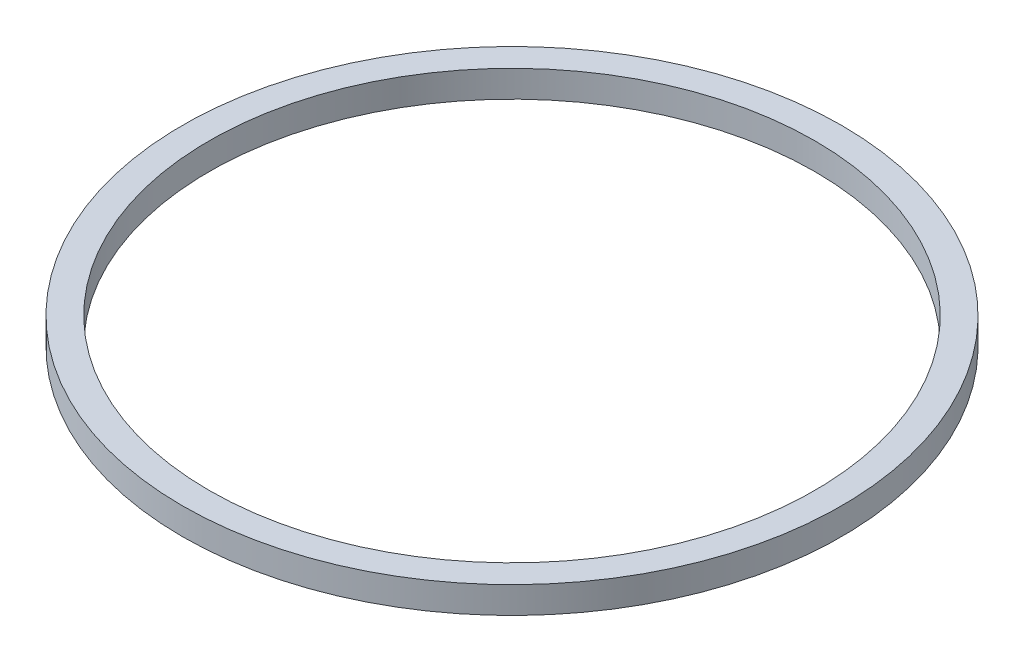
ISO-10303-21;
HEADER;
FILE_DESCRIPTION(('STEP AP214'),'2;1');
FILE_NAME('part.step','',(''),(''),'','','');
FILE_SCHEMA(('AUTOMOTIVE_DESIGN { 1 0 10303 214 1 1 1 1 }'));
ENDSEC;
DATA;
#1=APPLICATION_CONTEXT('core data for automotive mechanical design processes');
#2=APPLICATION_PROTOCOL_DEFINITION('international standard','automotive_design',2000,#1);
#3=PRODUCT_CONTEXT('',#1,'mechanical');
#4=PRODUCT('Part','Part','',(#3));
#5=PRODUCT_RELATED_PRODUCT_CATEGORY('part','',(#4));
#6=PRODUCT_DEFINITION_FORMATION('','',#4);
#7=PRODUCT_DEFINITION_CONTEXT('part definition',#1,'design');
#8=PRODUCT_DEFINITION('design','',#6,#7);
#9=PRODUCT_DEFINITION_SHAPE('','',#8);
#10=(LENGTH_UNIT() NAMED_UNIT(*) SI_UNIT(.MILLI.,.METRE.));
#11=(NAMED_UNIT(*) PLANE_ANGLE_UNIT() SI_UNIT($,.RADIAN.));
#12=(NAMED_UNIT(*) SI_UNIT($,.STERADIAN.) SOLID_ANGLE_UNIT());
#13=UNCERTAINTY_MEASURE_WITH_UNIT(LENGTH_MEASURE(1.E-05),#10,'distance_accuracy_value','');
#14=(GEOMETRIC_REPRESENTATION_CONTEXT(3) GLOBAL_UNCERTAINTY_ASSIGNED_CONTEXT((#13)) GLOBAL_UNIT_ASSIGNED_CONTEXT((#10,
#11,#12)) REPRESENTATION_CONTEXT('',''));
#15=CARTESIAN_POINT('',(0.,0.,0.));
#16=DIRECTION('',(0.,0.,1.));
#17=DIRECTION('',(1.,0.,0.));
#18=AXIS2_PLACEMENT_3D('',#15,#16,#17);
#19=CARTESIAN_POINT('',(0.,1.5,0.));
#20=DIRECTION('',(0.,1.,0.));
#21=DIRECTION('',(0.,0.,1.));
#22=AXIS2_PLACEMENT_3D('',#19,#20,#21);
#23=PLANE('',#22);
#24=CARTESIAN_POINT('',(0.,1.5,0.));
#25=DIRECTION('',(0.,1.,0.));
#26=DIRECTION('',(0.,0.,1.));
#27=AXIS2_PLACEMENT_3D('',#24,#25,#26);
#28=CIRCLE('',#27,17.);
#29=CARTESIAN_POINT('',(0.,1.5,17.));
#30=VERTEX_POINT('',#29);
#31=EDGE_CURVE('E26',#30,#30,#28,.F.);
#32=ORIENTED_EDGE('',*,*,#31,.T.);
#33=EDGE_LOOP('',(#32));
#34=FACE_BOUND('',#33,.T.);
#35=CARTESIAN_POINT('',(0.,1.5,0.));
#36=DIRECTION('',(0.,1.,0.));
#37=DIRECTION('',(0.,0.,1.));
#38=AXIS2_PLACEMENT_3D('',#35,#36,#37);
#39=CIRCLE('',#38,18.5);
#40=CARTESIAN_POINT('',(0.,1.5,18.5));
#41=VERTEX_POINT('',#40);
#42=EDGE_CURVE('E17',#41,#41,#39,.F.);
#43=ORIENTED_EDGE('',*,*,#42,.F.);
#44=EDGE_LOOP('',(#43));
#45=FACE_BOUND('',#44,.T.);
#46=ADVANCED_FACE('F14',(#34,#45),#23,.T.);
#47=CARTESIAN_POINT('',(0.,0.,0.));
#48=DIRECTION('',(0.,1.,0.));
#49=DIRECTION('',(0.,0.,1.));
#50=AXIS2_PLACEMENT_3D('',#47,#48,#49);
#51=CYLINDRICAL_SURFACE('',#50,18.5);
#52=ORIENTED_EDGE('',*,*,#42,.T.);
#53=EDGE_LOOP('',(#52));
#54=FACE_BOUND('',#53,.T.);
#55=CARTESIAN_POINT('',(0.,0.,0.));
#56=DIRECTION('',(0.,1.,0.));
#57=DIRECTION('',(0.,0.,1.));
#58=AXIS2_PLACEMENT_3D('',#55,#56,#57);
#59=CIRCLE('',#58,18.5);
#60=CARTESIAN_POINT('',(0.,0.,18.5));
#61=VERTEX_POINT('',#60);
#62=EDGE_CURVE('E21',#61,#61,#59,.T.);
#63=ORIENTED_EDGE('',*,*,#62,.T.);
#64=EDGE_LOOP('',(#63));
#65=FACE_BOUND('',#64,.T.);
#66=ADVANCED_FACE('F34',(#54,#65),#51,.T.);
#67=CARTESIAN_POINT('',(0.,0.,0.));
#68=DIRECTION('',(0.,1.,0.));
#69=DIRECTION('',(0.,0.,1.));
#70=AXIS2_PLACEMENT_3D('',#67,#68,#69);
#71=CYLINDRICAL_SURFACE('',#70,17.);
#72=ORIENTED_EDGE('',*,*,#31,.F.);
#73=EDGE_LOOP('',(#72));
#74=FACE_BOUND('',#73,.T.);
#75=CARTESIAN_POINT('',(0.,0.,0.));
#76=DIRECTION('',(0.,1.,0.));
#77=DIRECTION('',(0.,0.,1.));
#78=AXIS2_PLACEMENT_3D('',#75,#76,#77);
#79=CIRCLE('',#78,17.);
#80=CARTESIAN_POINT('',(0.,0.,17.));
#81=VERTEX_POINT('',#80);
#82=EDGE_CURVE('E10',#81,#81,#79,.F.);
#83=ORIENTED_EDGE('',*,*,#82,.T.);
#84=EDGE_LOOP('',(#83));
#85=FACE_BOUND('',#84,.T.);
#86=ADVANCED_FACE('F42',(#74,#85),#71,.F.);
#87=CARTESIAN_POINT('',(0.,0.,0.));
#88=DIRECTION('',(0.,1.,0.));
#89=DIRECTION('',(0.,0.,1.));
#90=AXIS2_PLACEMENT_3D('',#87,#88,#89);
#91=PLANE('',#90);
#92=ORIENTED_EDGE('',*,*,#82,.F.);
#93=EDGE_LOOP('',(#92));
#94=FACE_BOUND('',#93,.T.);
#95=ORIENTED_EDGE('',*,*,#62,.F.);
#96=EDGE_LOOP('',(#95));
#97=FACE_BOUND('',#96,.T.);
#98=ADVANCED_FACE('F43',(#94,#97),#91,.F.);
#99=CLOSED_SHELL('',(#46,#66,#86,#98));
#100=MANIFOLD_SOLID_BREP('B1',#99);
#101=ADVANCED_BREP_SHAPE_REPRESENTATION('',(#18,#100),#14);
#102=SHAPE_DEFINITION_REPRESENTATION(#9,#101);
ENDSEC;
END-ISO-10303-21;
